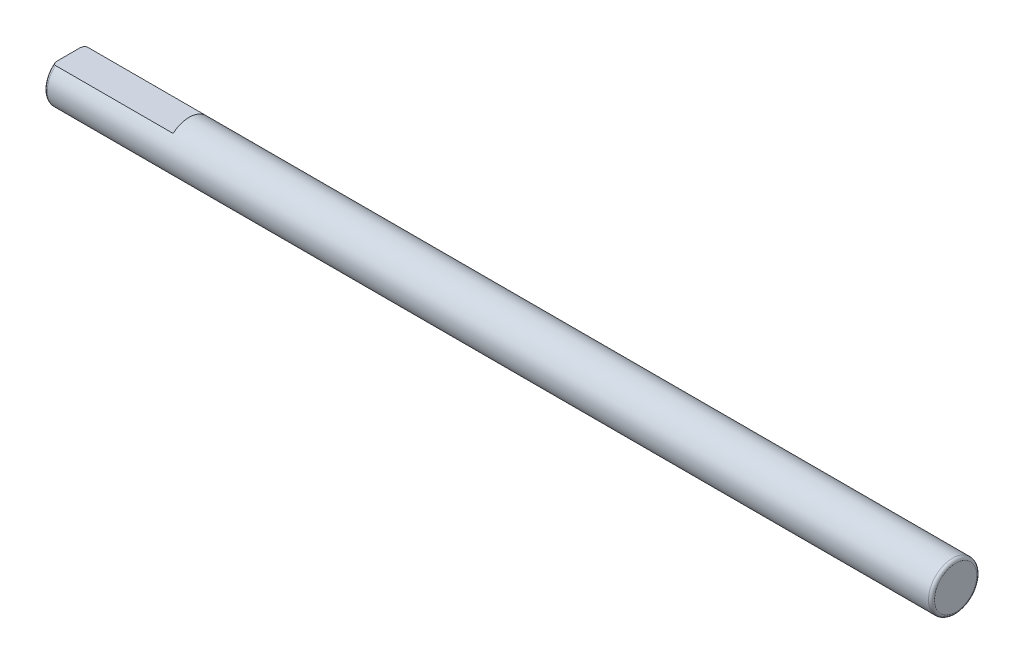
ISO-10303-21;
HEADER;
FILE_DESCRIPTION(('STEP AP214'),'2;1');
FILE_NAME('part.step','',(''),(''),'','','');
FILE_SCHEMA(('AUTOMOTIVE_DESIGN { 1 0 10303 214 1 1 1 1 }'));
ENDSEC;
DATA;
#1=APPLICATION_CONTEXT('core data for automotive mechanical design processes');
#2=APPLICATION_PROTOCOL_DEFINITION('international standard','automotive_design',2000,#1);
#3=PRODUCT_CONTEXT('',#1,'mechanical');
#4=PRODUCT('Part','Part','',(#3));
#5=PRODUCT_RELATED_PRODUCT_CATEGORY('part','',(#4));
#6=PRODUCT_DEFINITION_FORMATION('','',#4);
#7=PRODUCT_DEFINITION_CONTEXT('part definition',#1,'design');
#8=PRODUCT_DEFINITION('design','',#6,#7);
#9=PRODUCT_DEFINITION_SHAPE('','',#8);
#10=(LENGTH_UNIT() NAMED_UNIT(*) SI_UNIT(.MILLI.,.METRE.));
#11=(NAMED_UNIT(*) PLANE_ANGLE_UNIT() SI_UNIT($,.RADIAN.));
#12=(NAMED_UNIT(*) SI_UNIT($,.STERADIAN.) SOLID_ANGLE_UNIT());
#13=UNCERTAINTY_MEASURE_WITH_UNIT(LENGTH_MEASURE(1.E-05),#10,'distance_accuracy_value','');
#14=(GEOMETRIC_REPRESENTATION_CONTEXT(3) GLOBAL_UNCERTAINTY_ASSIGNED_CONTEXT((#13)) GLOBAL_UNIT_ASSIGNED_CONTEXT((#10,
#11,#12)) REPRESENTATION_CONTEXT('',''));
#15=CARTESIAN_POINT('',(0.,0.,0.));
#16=DIRECTION('',(0.,0.,1.));
#17=DIRECTION('',(1.,0.,0.));
#18=AXIS2_PLACEMENT_3D('',#15,#16,#17);
#19=CARTESIAN_POINT('',(147.,0.,0.));
#20=DIRECTION('',(-1.,0.,0.));
#21=DIRECTION('',(0.,0.,1.));
#22=AXIS2_PLACEMENT_3D('',#19,#20,#21);
#23=CYLINDRICAL_SURFACE('',#22,4.);
#24=CARTESIAN_POINT('',(146.5,0.,0.));
#25=DIRECTION('',(1.,0.,0.));
#26=DIRECTION('',(0.,0.,-1.));
#27=AXIS2_PLACEMENT_3D('',#24,#25,#26);
#28=CIRCLE('',#27,4.);
#29=CARTESIAN_POINT('',(146.5,0.,-4.));
#30=VERTEX_POINT('',#29);
#31=EDGE_CURVE('E76',#30,#30,#28,.F.);
#32=ORIENTED_EDGE('',*,*,#31,.T.);
#33=EDGE_LOOP('',(#32));
#34=FACE_BOUND('',#33,.T.);
#35=CARTESIAN_POINT('',(20.,0.,0.));
#36=DIRECTION('',(-1.,0.,0.));
#37=DIRECTION('',(0.,0.,1.));
#38=AXIS2_PLACEMENT_3D('',#35,#36,#37);
#39=CIRCLE('',#38,4.);
#40=CARTESIAN_POINT('',(20.,3.,2.64575131106459));
#41=VERTEX_POINT('',#40);
#42=CARTESIAN_POINT('',(20.,3.,-2.64575131106459));
#43=VERTEX_POINT('',#42);
#44=EDGE_CURVE('E11',#41,#43,#39,.T.);
#45=ORIENTED_EDGE('',*,*,#44,.F.);
#46=DIRECTION('',(-1.,0.,0.));
#47=VECTOR('',#46,1.);
#48=CARTESIAN_POINT('',(147.,3.,2.64575131106459));
#49=LINE('',#48,#47);
#50=CARTESIAN_POINT('',(0.499999999999951,3.,2.64575131106459));
#51=VERTEX_POINT('',#50);
#52=EDGE_CURVE('E118',#41,#51,#49,.T.);
#53=ORIENTED_EDGE('',*,*,#52,.T.);
#54=CARTESIAN_POINT('',(0.5,0.,0.));
#55=DIRECTION('',(1.,0.,0.));
#56=DIRECTION('',(0.,0.,-1.));
#57=AXIS2_PLACEMENT_3D('',#54,#55,#56);
#58=CIRCLE('',#57,4.);
#59=CARTESIAN_POINT('',(0.50000000000005,3.,-2.64575131106459));
#60=VERTEX_POINT('',#59);
#61=EDGE_CURVE('E80',#51,#60,#58,.T.);
#62=ORIENTED_EDGE('',*,*,#61,.T.);
#63=DIRECTION('',(-1.,0.,0.));
#64=VECTOR('',#63,1.);
#65=CARTESIAN_POINT('',(147.,3.,-2.64575131106459));
#66=LINE('',#65,#64);
#67=EDGE_CURVE('E54',#60,#43,#66,.F.);
#68=ORIENTED_EDGE('',*,*,#67,.T.);
#69=EDGE_LOOP('',(#45,#53,#62,#68));
#70=FACE_BOUND('',#69,.T.);
#71=ADVANCED_FACE('F32',(#34,#70),#23,.T.);
#72=CARTESIAN_POINT('',(147.,0.,0.));
#73=DIRECTION('',(1.,0.,0.));
#74=DIRECTION('',(0.,0.,-1.));
#75=AXIS2_PLACEMENT_3D('',#72,#73,#74);
#76=PLANE('',#75);
#77=CARTESIAN_POINT('',(147.,0.,0.));
#78=DIRECTION('',(1.,0.,0.));
#79=DIRECTION('',(0.,0.,-1.));
#80=AXIS2_PLACEMENT_3D('',#77,#78,#79);
#81=CIRCLE('',#80,3.5);
#82=CARTESIAN_POINT('',(147.,0.,-3.5));
#83=VERTEX_POINT('',#82);
#84=EDGE_CURVE('E116',#83,#83,#81,.T.);
#85=ORIENTED_EDGE('',*,*,#84,.T.);
#86=EDGE_LOOP('',(#85));
#87=FACE_BOUND('',#86,.T.);
#88=ADVANCED_FACE('F97',(#87),#76,.T.);
#89=CARTESIAN_POINT('',(0.,0.,0.));
#90=DIRECTION('',(1.,0.,0.));
#91=DIRECTION('',(0.,0.,-1.));
#92=AXIS2_PLACEMENT_3D('',#89,#90,#91);
#93=PLANE('',#92);
#94=CARTESIAN_POINT('',(0.,0.,0.));
#95=DIRECTION('',(1.,0.,0.));
#96=DIRECTION('',(0.,0.,-1.));
#97=AXIS2_PLACEMENT_3D('',#94,#95,#96);
#98=CIRCLE('',#97,3.5);
#99=CARTESIAN_POINT('',(0.,3.,-1.802775637732));
#100=VERTEX_POINT('',#99);
#101=CARTESIAN_POINT('',(0.,3.,1.802775637732));
#102=VERTEX_POINT('',#101);
#103=EDGE_CURVE('E73',#100,#102,#98,.F.);
#104=ORIENTED_EDGE('',*,*,#103,.T.);
#105=DIRECTION('',(0.,0.,1.));
#106=VECTOR('',#105,1.);
#107=CARTESIAN_POINT('',(0.,3.,-3.0891487911814));
#108=LINE('',#107,#106);
#109=EDGE_CURVE('E48',#100,#102,#108,.T.);
#110=ORIENTED_EDGE('',*,*,#109,.F.);
#111=EDGE_LOOP('',(#104,#110));
#112=FACE_BOUND('',#111,.T.);
#113=ADVANCED_FACE('F72',(#112),#93,.F.);
#114=CARTESIAN_POINT('',(146.5,0.,0.));
#115=DIRECTION('',(1.,0.,0.));
#116=DIRECTION('',(0.,0.,-1.));
#117=AXIS2_PLACEMENT_3D('',#114,#115,#116);
#118=TOROIDAL_SURFACE('',#117,3.5,0.5);
#119=ORIENTED_EDGE('',*,*,#31,.F.);
#120=EDGE_LOOP('',(#119));
#121=FACE_BOUND('',#120,.T.);
#122=ORIENTED_EDGE('',*,*,#84,.F.);
#123=EDGE_LOOP('',(#122));
#124=FACE_BOUND('',#123,.T.);
#125=ADVANCED_FACE('F104',(#121,#124),#118,.T.);
#126=CARTESIAN_POINT('',(0.5,0.,0.));
#127=DIRECTION('',(1.,0.,0.));
#128=DIRECTION('',(0.,0.,-1.));
#129=AXIS2_PLACEMENT_3D('',#126,#127,#128);
#130=TOROIDAL_SURFACE('',#129,3.5,0.5);
#131=CARTESIAN_POINT('',(0.5,3.,0.));
#132=CARTESIAN_POINT('',(0.500000809088146,3.,-3.2934607506314E-10));
#133=CARTESIAN_POINT('',(0.500001618108411,3.,-1.67667279640265E-07));
#134=CARTESIAN_POINT('',(0.500003176606055,3.,-6.9945231536977E-07));
#135=CARTESIAN_POINT('',(0.500003923981369,3.,-1.06892420157277E-06));
#136=CARTESIAN_POINT('',(0.500005413740321,3.,-1.9570834816732E-06));
#137=CARTESIAN_POINT('',(0.500006149872059,3.,-2.48605601121779E-06));
#138=CARTESIAN_POINT('',(0.50000754034948,3.,-3.62802522910673E-06));
#139=CARTESIAN_POINT('',(0.500008195307211,3.,-4.24030942558303E-06));
#140=CARTESIAN_POINT('',(0.500010385105272,3.,-6.43180846500297E-06));
#141=CARTESIAN_POINT('',(0.500011811987412,3.,-8.12039536722845E-06));
#142=CARTESIAN_POINT('',(0.500014359628101,3.,-1.16140419291981E-05));
#143=CARTESIAN_POINT('',(0.500015489395678,3.,-1.34129078724813E-05));
#144=CARTESIAN_POINT('',(0.50001971989055,3.,-2.04163342887109E-05));
#145=CARTESIAN_POINT('',(0.500022598011228,3.,-2.57614968734041E-05));
#146=CARTESIAN_POINT('',(0.500027318652184,3.,-3.63150304880423E-05));
#147=CARTESIAN_POINT('',(0.50002923041933,3.,-4.14934293805156E-05));
#148=CARTESIAN_POINT('',(0.500037327276918,3.,-6.35047206306328E-05));
#149=CARTESIAN_POINT('',(0.500043450710295,3.,-8.03491167271492E-05));
#150=CARTESIAN_POINT('',(0.500053306845904,3.,-0.000111903145406854));
#151=CARTESIAN_POINT('',(0.500057262814986,3.,-0.000126540106854419));
#152=CARTESIAN_POINT('',(0.500088519055675,3.,-0.000232715488464067));
#153=CARTESIAN_POINT('',(0.500128266452262,3.,-0.000320029134275242));
#154=CARTESIAN_POINT('',(0.500276959950626,3.,-0.000659124701096024));
#155=CARTESIAN_POINT('',(0.500376660339702,3.,-0.000913839636284209));
#156=CARTESIAN_POINT('',(0.500769024539738,3.,-0.00190151482622701));
#157=CARTESIAN_POINT('',(0.50107137796929,3.,-0.00263146538292722));
#158=CARTESIAN_POINT('',(0.502303116986653,3.,-0.00561938141922183));
#159=CARTESIAN_POINT('',(0.503221567826035,3.,-0.00788067423083214));
#160=CARTESIAN_POINT('',(0.521363727066382,3.,-0.0525294961269583));
#161=CARTESIAN_POINT('',(0.538706292206086,3.,-0.0948814603897114));
#162=CARTESIAN_POINT('',(0.572537841038551,3.,-0.178106178364997));
#163=CARTESIAN_POINT('',(0.589034737743194,3.,-0.218975962780763));
#164=CARTESIAN_POINT('',(0.623682560408479,3.,-0.305580211857914));
#165=CARTESIAN_POINT('',(0.641802551140837,3.,-0.35132729187215));
#166=CARTESIAN_POINT('',(0.677703045345115,3.,-0.443490069714424));
#167=CARTESIAN_POINT('',(0.695478237205682,3.,-0.489907841384319));
#168=CARTESIAN_POINT('',(0.725749928723063,3.,-0.570834253560249));
#169=CARTESIAN_POINT('',(0.738410736434121,3.,-0.605281249358845));
#170=CARTESIAN_POINT('',(0.763222224720536,3.,-0.674264199384321));
#171=CARTESIAN_POINT('',(0.775374066081844,3.,-0.708799736354263));
#172=CARTESIAN_POINT('',(0.810446908527797,3.,-0.811138279206476));
#173=CARTESIAN_POINT('',(0.832571047185817,3.,-0.879218053507057));
#174=CARTESIAN_POINT('',(0.876921950991112,3.,-1.02618826213861));
#175=CARTESIAN_POINT('',(0.898699659227395,3.,-1.10521659285786));
#176=CARTESIAN_POINT('',(0.937294199860766,3.,-1.26517799044851));
#177=CARTESIAN_POINT('',(0.954069937301385,3.,-1.346121239105));
#178=CARTESIAN_POINT('',(0.981496647216805,3.,-1.51404150066003));
#179=CARTESIAN_POINT('',(0.991723486153632,3.,-1.60109082141265));
#180=CARTESIAN_POINT('',(1.0016304665507,3.,-1.77557216985603));
#181=CARTESIAN_POINT('',(1.00135814278864,3.,-1.86300068112729));
#182=CARTESIAN_POINT('',(0.988651759554046,3.,-2.01061403624832));
#183=CARTESIAN_POINT('',(0.979893031996419,3.,-2.07109870196367));
#184=CARTESIAN_POINT('',(0.953502893424042,3.,-2.18949411855467));
#185=CARTESIAN_POINT('',(0.935986358665715,3.,-2.24742789116418));
#186=CARTESIAN_POINT('',(0.900039704312819,3.,-2.33381307952221));
#187=CARTESIAN_POINT('',(0.885506746912705,3.,-2.36388244266121));
#188=CARTESIAN_POINT('',(0.85245040783283,3.,-2.42185524072283));
#189=CARTESIAN_POINT('',(0.833922633916885,3.,-2.44975624526212));
#190=CARTESIAN_POINT('',(0.7965825454489,3.,-2.49689419782548));
#191=CARTESIAN_POINT('',(0.778559028637205,3.,-2.51675087661283));
#192=CARTESIAN_POINT('',(0.739572103071065,3.,-2.55333362983963));
#193=CARTESIAN_POINT('',(0.718614464165329,3.,-2.57006570152396));
#194=CARTESIAN_POINT('',(0.67891078425283,3.,-2.59602672464035));
#195=CARTESIAN_POINT('',(0.660717264579315,3.,-2.60609681859337));
#196=CARTESIAN_POINT('',(0.622912563737041,3.,-2.623112296613));
#197=CARTESIAN_POINT('',(0.603302253722279,3.,-2.63005958216399));
#198=CARTESIAN_POINT('',(0.56301476320006,3.,-2.64036273771542));
#199=CARTESIAN_POINT('',(0.542331701205913,3.,-2.64369598136285));
#200=CARTESIAN_POINT('',(0.500707916843597,3.,-2.64640559948722));
#201=CARTESIAN_POINT('',(0.479767281713323,3.,-2.64578327874975));
#202=CARTESIAN_POINT('',(0.440427583184487,3.,-2.64089905702711));
#203=CARTESIAN_POINT('',(0.421981538311264,3.,-2.63700214813721));
#204=CARTESIAN_POINT('',(0.385956215176315,3.,-2.62631149761408));
#205=CARTESIAN_POINT('',(0.36837708063967,3.,-2.61951727742486));
#206=CARTESIAN_POINT('',(0.333556054029368,3.,-2.60301019185976));
#207=CARTESIAN_POINT('',(0.316376843936938,3.,-2.5931663991519));
#208=CARTESIAN_POINT('',(0.283553635483454,3.,-2.57120495735787));
#209=CARTESIAN_POINT('',(0.267910319926095,3.,-2.55908630385892));
#210=CARTESIAN_POINT('',(0.229405446050632,3.,-2.52528761959886));
#211=CARTESIAN_POINT('',(0.207773904467145,3.,-2.50220323171021));
#212=CARTESIAN_POINT('',(0.168418923512549,3.,-2.45289119290977));
#213=CARTESIAN_POINT('',(0.150708217228096,3.,-2.42665371575611));
#214=CARTESIAN_POINT('',(0.110266308186318,3.,-2.35741023828566));
#215=CARTESIAN_POINT('',(0.0899740483454385,3.,-2.31298826255613));
#216=CARTESIAN_POINT('',(0.0564099001066308,3.,-2.22176394892125));
#217=CARTESIAN_POINT('',(0.043130411782171,3.,-2.17496424838651));
#218=CARTESIAN_POINT('',(0.0237633730551337,3.,-2.08697565597443));
#219=CARTESIAN_POINT('',(0.0169163061931374,3.,-2.04594747659781));
#220=CARTESIAN_POINT('',(0.00675967641004121,3.,-1.9634385868835));
#221=CARTESIAN_POINT('',(0.00345312236565857,3.,-1.9219575218554));
#222=CARTESIAN_POINT('',(-0.00201025293698873,3.,-1.79591946738754));
#223=CARTESIAN_POINT('',(0.000554770585140939,3.,-1.71115993553401));
#224=CARTESIAN_POINT('',(0.0174300288954169,3.,-1.51140251574389));
#225=CARTESIAN_POINT('',(0.0357272025744261,3.,-1.39679487716935));
#226=CARTESIAN_POINT('',(0.0838375443384744,3.,-1.16962376031828));
#227=CARTESIAN_POINT('',(0.113705882630573,3.,-1.05707282200538));
#228=CARTESIAN_POINT('',(0.178080307857804,3.,-0.844082202523085));
#229=CARTESIAN_POINT('',(0.21195188804201,3.,-0.74344452314468));
#230=CARTESIAN_POINT('',(0.283327157203447,3.,-0.544693937069991));
#231=CARTESIAN_POINT('',(0.320788645994851,3.,-0.446565585026118));
#232=CARTESIAN_POINT('',(0.368707849371471,3.,-0.324872681130772));
#233=CARTESIAN_POINT('',(0.3782096425379,3.,-0.300922641925631));
#234=CARTESIAN_POINT('',(0.39756530065873,3.,-0.252430502986033));
#235=CARTESIAN_POINT('',(0.407421839456958,3.,-0.227889458246371));
#236=CARTESIAN_POINT('',(0.43092611634603,3.,-0.169596396492738));
#237=CARTESIAN_POINT('',(0.444603443763393,3.,-0.135856755555247));
#238=CARTESIAN_POINT('',(0.470842624326647,3.,-0.0714698247451515));
#239=CARTESIAN_POINT('',(0.483393596859186,3.,-0.0408185928270958));
#240=CARTESIAN_POINT('',(0.496776257167533,3.,-0.00788623845360394));
#241=CARTESIAN_POINT('',(0.497692413042641,3.,-0.00563047352138915));
#242=CARTESIAN_POINT('',(0.49892354895344,3.,-0.0026439047168306));
#243=CARTESIAN_POINT('',(0.499227629346511,3.,-0.00190978863955239));
#244=CARTESIAN_POINT('',(0.499622097652642,3.,-0.000916812623804387));
#245=CARTESIAN_POINT('',(0.49972223716506,3.,-0.000660978772585737));
#246=CARTESIAN_POINT('',(0.499871515509436,3.,-0.000320570794487707));
#247=CARTESIAN_POINT('',(0.499911357741668,3.,-0.000233049169458826));
#248=CARTESIAN_POINT('',(0.499942667595315,3.,-0.000126636222343927));
#249=CARTESIAN_POINT('',(0.49994662572238,3.,-0.00011198349258714));
#250=CARTESIAN_POINT('',(0.499956493457853,3.,-8.03948799674941E-05));
#251=CARTESIAN_POINT('',(0.499962627668005,3.,-6.35320960836763E-05));
#252=CARTESIAN_POINT('',(0.499970738141426,3.,-4.15001682322679E-05));
#253=CARTESIAN_POINT('',(0.499972652283502,3.,-3.63192959757123E-05));
#254=CARTESIAN_POINT('',(0.499977379167323,3.,-2.57611213342259E-05));
#255=CARTESIAN_POINT('',(0.499980261301865,3.,-2.04138799617288E-05));
#256=CARTESIAN_POINT('',(0.499984497373793,3.,-1.34085100346821E-05));
#257=CARTESIAN_POINT('',(0.499985628444553,3.,-1.16094520804406E-05));
#258=CARTESIAN_POINT('',(0.499988178909839,3.,-8.11568090045751E-06));
#259=CARTESIAN_POINT('',(0.499989607322178,3.,-6.42717404158496E-06));
#260=CARTESIAN_POINT('',(0.499991799264343,3.,-4.23609541338912E-06));
#261=CARTESIAN_POINT('',(0.499992454809909,3.,-3.62399400351353E-06));
#262=CARTESIAN_POINT('',(0.499993846467545,3.,-2.48249549911878E-06));
#263=CARTESIAN_POINT('',(0.499994583191879,3.,-1.95381202778724E-06));
#264=CARTESIAN_POINT('',(0.499996074032542,3.,-1.06635169280823E-06));
#265=CARTESIAN_POINT('',(0.499996821897943,3.,-6.97275834581454E-07));
#266=CARTESIAN_POINT('',(0.499998381265326,3.,-1.66450950331506E-07));
#267=CARTESIAN_POINT('',(0.499999190666624,3.,3.29445898566957E-10));
#268=CARTESIAN_POINT('',(0.5,3.,0.));
#269=B_SPLINE_CURVE_WITH_KNOTS('',3,(#131,#132,#133,#134,#135,#136,#137,#138,#139,#140,#141,
#142,#143,#144,#145,#146,#147,#148,#149,#150,#151,#152,#153,#154,#155,#156,#157,#158,#159,#160,
#161,#162,#163,#164,#165,#166,#167,#168,#169,#170,#171,#172,#173,#174,#175,#176,#177,#178,#179,
#180,#181,#182,#183,#184,#185,#186,#187,#188,#189,#190,#191,#192,#193,#194,#195,#196,#197,#198,
#199,#200,#201,#202,#203,#204,#205,#206,#207,#208,#209,#210,#211,#212,#213,#214,#215,#216,#217,
#218,#219,#220,#221,#222,#223,#224,#225,#226,#227,#228,#229,#230,#231,#232,#233,#234,#235,#236,
#237,#238,#239,#240,#241,#242,#243,#244,#245,#246,#247,#248,#249,#250,#251,#252,#253,#254,#255,
#256,#257,#258,#259,#260,#261,#262,#263,#264,#265,#266,#267,#268),.UNSPECIFIED.,.T.,.F.,(4,2,2,
2,2,2,2,2,2,2,2,2,2,2,2,2,2,2,2,2,2,2,2,2,2,2,2,2,2,2,2,2,2,2,2,2,2,2,2,2,2,2,2,2,2,2,2,2,2,2,2,
2,2,2,2,2,2,2,2,2,2,2,2,2,2,2,2,2,4),(0.,2.42577140557126E-06,4.91478110570216E-06,
7.62327817523988E-06,1.03099186208152E-05,1.69098728522729E-05,2.32774624627675E-05,
4.14315821071887E-05,5.79742803822167E-05,0.000111731604111281,0.000157176209987339,
0.000443854285448882,0.00126537151567835,0.00363449825944129,0.0109577843232788,
0.14823796152855,0.280462080852896,0.428073969058702,0.577183919440007,0.687280760477523,
0.797111062900995,1.01181718035164,1.25761408968685,1.50537803059263,1.76789367938719,
2.02922093329222,2.21210120104423,2.39264319721214,2.4926047048953,2.59267668424855,
2.67285452731945,2.75287686200225,2.81501496252162,2.87711517560124,2.93960197229294,
3.00206815811057,3.05837386128685,3.11468886821825,3.17386957128519,3.23307646596263,
3.32744250264447,3.42211064246199,3.56780261152902,3.71333636463611,3.83794603621182,
3.96266152248216,4.21629845213776,4.56358436079346,4.9125468888076,5.23097433673934,
5.5460342126434,5.62333278485183,5.70267125442574,5.81189399554254,5.9112473332884,
5.91855267841801,5.92093532155446,5.92176045135823,5.92204781085149,5.92209330261594,
5.92214712248503,5.92216367456895,5.92218183971372,5.92218820986477,5.92219481255307,
5.922197500105,5.92220020952932,5.92220269932133,5.92220512582798),.UNSPECIFIED.);
#270=EDGE_CURVE('E41',#60,#100,#269,.T.);
#271=ORIENTED_EDGE('',*,*,#270,.F.);
#272=ORIENTED_EDGE('',*,*,#61,.F.);
#273=CARTESIAN_POINT('',(0.5,3.,0.));
#274=CARTESIAN_POINT('',(0.499999190911855,3.,3.29346080531089E-10));
#275=CARTESIAN_POINT('',(0.49999838189159,3.,1.67667279645256E-07));
#276=CARTESIAN_POINT('',(0.499996823393946,3.,6.99452315387634E-07));
#277=CARTESIAN_POINT('',(0.499996076018632,3.,1.06892420161261E-06));
#278=CARTESIAN_POINT('',(0.49999458625968,3.,1.95708348167848E-06));
#279=CARTESIAN_POINT('',(0.499993850127941,3.,2.48605601116866E-06));
#280=CARTESIAN_POINT('',(0.49999245965052,3.,3.62802522906312E-06));
#281=CARTESIAN_POINT('',(0.499991804692789,3.,4.24030942558021E-06));
#282=CARTESIAN_POINT('',(0.499989614894729,3.,6.43180846513845E-06));
#283=CARTESIAN_POINT('',(0.499988188012589,3.,8.12039536717703E-06));
#284=CARTESIAN_POINT('',(0.499985640371899,3.,1.16140419290538E-05));
#285=CARTESIAN_POINT('',(0.499984510604323,3.,1.34129078724051E-05));
#286=CARTESIAN_POINT('',(0.499980280109451,3.,2.04163342888789E-05));
#287=CARTESIAN_POINT('',(0.499977401988773,3.,2.57614968734216E-05));
#288=CARTESIAN_POINT('',(0.499972681347817,3.,3.63150304879688E-05));
#289=CARTESIAN_POINT('',(0.499970769580671,3.,4.14934293804847E-05));
#290=CARTESIAN_POINT('',(0.499962672723083,3.,6.35047206307141E-05));
#291=CARTESIAN_POINT('',(0.499956549289706,3.,8.03491167271915E-05));
#292=CARTESIAN_POINT('',(0.499946693154097,3.,0.000111903145406862));
#293=CARTESIAN_POINT('',(0.499942737185014,3.,0.000126540106854423));
#294=CARTESIAN_POINT('',(0.499911480944326,3.,0.000232715488464098));
#295=CARTESIAN_POINT('',(0.499871733547738,3.,0.000320029134275249));
#296=CARTESIAN_POINT('',(0.499723040049375,3.,0.000659124701095968));
#297=CARTESIAN_POINT('',(0.499623339660299,3.,0.00091383963628417));
#298=CARTESIAN_POINT('',(0.499230975460263,3.,0.00190151482622701));
#299=CARTESIAN_POINT('',(0.498928622030711,3.,0.00263146538292719));
#300=CARTESIAN_POINT('',(0.497696883013348,3.,0.00561938141922179));
#301=CARTESIAN_POINT('',(0.496778432173966,3.,0.00788067423083212));
#302=CARTESIAN_POINT('',(0.478636272933618,3.,0.0525294961269583));
#303=CARTESIAN_POINT('',(0.461293707793911,3.,0.0948814603897104));
#304=CARTESIAN_POINT('',(0.427462158961447,3.,0.178106178364996));
#305=CARTESIAN_POINT('',(0.410965262256806,3.,0.218975962780763));
#306=CARTESIAN_POINT('',(0.376317439591523,3.,0.305580211857916));
#307=CARTESIAN_POINT('',(0.358197448859163,3.,0.351327291872151));
#308=CARTESIAN_POINT('',(0.322296954654884,3.,0.443490069714426));
#309=CARTESIAN_POINT('',(0.304521762794318,3.,0.489907841384323));
#310=CARTESIAN_POINT('',(0.274250071276937,3.,0.570834253560253));
#311=CARTESIAN_POINT('',(0.261589263565879,3.,0.605281249358848));
#312=CARTESIAN_POINT('',(0.236777775279463,3.,0.674264199384323));
#313=CARTESIAN_POINT('',(0.224625933918156,3.,0.708799736354265));
#314=CARTESIAN_POINT('',(0.189553091472204,3.,0.811138279206477));
#315=CARTESIAN_POINT('',(0.167428952814184,3.,0.879218053507057));
#316=CARTESIAN_POINT('',(0.123078049008889,3.,1.02618826213861));
#317=CARTESIAN_POINT('',(0.101300340772606,3.,1.10521659285786));
#318=CARTESIAN_POINT('',(0.0627058001392351,3.,1.26517799044851));
#319=CARTESIAN_POINT('',(0.0459300626986163,3.,1.346121239105));
#320=CARTESIAN_POINT('',(0.0185033527831959,3.,1.51404150066003));
#321=CARTESIAN_POINT('',(0.00827651384636933,3.,1.60109082141265));
#322=CARTESIAN_POINT('',(-0.00163046655070144,3.,1.77557216985603));
#323=CARTESIAN_POINT('',(-0.0013581427886383,3.,1.86300068112729));
#324=CARTESIAN_POINT('',(0.0113482404459548,3.,2.01061403624832));
#325=CARTESIAN_POINT('',(0.020106968003582,3.,2.07109870196367));
#326=CARTESIAN_POINT('',(0.0464971065759595,3.,2.18949411855468));
#327=CARTESIAN_POINT('',(0.0640136413342866,3.,2.24742789116418));
#328=CARTESIAN_POINT('',(0.0999602956871824,3.,2.33381307952221));
#329=CARTESIAN_POINT('',(0.114493253087296,3.,2.36388244266121));
#330=CARTESIAN_POINT('',(0.147549592167171,3.,2.42185524072283));
#331=CARTESIAN_POINT('',(0.166077366083116,3.,2.44975624526212));
#332=CARTESIAN_POINT('',(0.203417454551101,3.,2.49689419782548));
#333=CARTESIAN_POINT('',(0.221440971362795,3.,2.51675087661283));
#334=CARTESIAN_POINT('',(0.260427896928936,3.,2.55333362983963));
#335=CARTESIAN_POINT('',(0.281385535834672,3.,2.57006570152396));
#336=CARTESIAN_POINT('',(0.321089215747171,3.,2.59602672464035));
#337=CARTESIAN_POINT('',(0.339282735420686,3.,2.60609681859337));
#338=CARTESIAN_POINT('',(0.37708743626296,3.,2.623112296613));
#339=CARTESIAN_POINT('',(0.396697746277722,3.,2.63005958216399));
#340=CARTESIAN_POINT('',(0.43698523679994,3.,2.64036273771542));
#341=CARTESIAN_POINT('',(0.457668298794088,3.,2.64369598136285));
#342=CARTESIAN_POINT('',(0.499292083156404,3.,2.64640559948722));
#343=CARTESIAN_POINT('',(0.520232718286677,3.,2.64578327874975));
#344=CARTESIAN_POINT('',(0.559572416815514,3.,2.64089905702711));
#345=CARTESIAN_POINT('',(0.578018461688736,3.,2.63700214813721));
#346=CARTESIAN_POINT('',(0.614043784823686,3.,2.62631149761408));
#347=CARTESIAN_POINT('',(0.631622919360331,3.,2.61951727742486));
#348=CARTESIAN_POINT('',(0.666443945970632,3.,2.60301019185976));
#349=CARTESIAN_POINT('',(0.683623156063063,3.,2.5931663991519));
#350=CARTESIAN_POINT('',(0.716446364516547,3.,2.57120495735787));
#351=CARTESIAN_POINT('',(0.732089680073906,3.,2.55908630385892));
#352=CARTESIAN_POINT('',(0.770594553949369,3.,2.52528761959886));
#353=CARTESIAN_POINT('',(0.792226095532856,3.,2.50220323171021));
#354=CARTESIAN_POINT('',(0.831581076487452,3.,2.45289119290977));
#355=CARTESIAN_POINT('',(0.849291782771905,3.,2.42665371575611));
#356=CARTESIAN_POINT('',(0.889733691813683,3.,2.35741023828566));
#357=CARTESIAN_POINT('',(0.910025951654562,3.,2.31298826255613));
#358=CARTESIAN_POINT('',(0.94359009989337,3.,2.22176394892125));
#359=CARTESIAN_POINT('',(0.95686958821783,3.,2.17496424838651));
#360=CARTESIAN_POINT('',(0.976236626944867,3.,2.08697565597443));
#361=CARTESIAN_POINT('',(0.983083693806863,3.,2.04594747659781));
#362=CARTESIAN_POINT('',(0.993240323589959,3.,1.9634385868835));
#363=CARTESIAN_POINT('',(0.996546877634342,3.,1.9219575218554));
#364=CARTESIAN_POINT('',(1.00201025293699,3.,1.79591946738754));
#365=CARTESIAN_POINT('',(0.99944522941486,3.,1.71115993553401));
#366=CARTESIAN_POINT('',(0.982569971104584,3.,1.5114025157439));
#367=CARTESIAN_POINT('',(0.964272797425575,3.,1.39679487716935));
#368=CARTESIAN_POINT('',(0.916162455661528,3.,1.16962376031828));
#369=CARTESIAN_POINT('',(0.88629411736943,3.,1.05707282200538));
#370=CARTESIAN_POINT('',(0.821919692142198,3.,0.844082202523089));
#371=CARTESIAN_POINT('',(0.788048111957992,3.,0.743444523144685));
#372=CARTESIAN_POINT('',(0.716672842796557,3.,0.544693937069997));
#373=CARTESIAN_POINT('',(0.679211354005154,3.,0.446565585026125));
#374=CARTESIAN_POINT('',(0.631292150628532,3.,0.32487268113078));
#375=CARTESIAN_POINT('',(0.621790357462102,3.,0.300922641925638));
#376=CARTESIAN_POINT('',(0.602434699341271,3.,0.252430502986038));
#377=CARTESIAN_POINT('',(0.592578160543043,3.,0.227889458246376));
#378=CARTESIAN_POINT('',(0.569073883653971,3.,0.169596396492741));
#379=CARTESIAN_POINT('',(0.555396556236608,3.,0.135856755555249));
#380=CARTESIAN_POINT('',(0.529157375673355,3.,0.0714698247451526));
#381=CARTESIAN_POINT('',(0.516606403140817,3.,0.0408185928270963));
#382=CARTESIAN_POINT('',(0.503223742832466,3.,0.00788623845360452));
#383=CARTESIAN_POINT('',(0.502307586957358,3.,0.00563047352138977));
#384=CARTESIAN_POINT('',(0.501076451046561,3.,0.00264390471683072));
#385=CARTESIAN_POINT('',(0.500772370653491,3.,0.00190978863955234));
#386=CARTESIAN_POINT('',(0.500377902347358,3.,0.000916812623804518));
#387=CARTESIAN_POINT('',(0.50027776283494,3.,0.000660978772585944));
#388=CARTESIAN_POINT('',(0.500128484490565,3.,0.000320570794487669));
#389=CARTESIAN_POINT('',(0.500088642258334,3.,0.00023304916945869));
#390=CARTESIAN_POINT('',(0.500057332404686,3.,0.000126636222343655));
#391=CARTESIAN_POINT('',(0.500053374277621,3.,0.000111983492586593));
#392=CARTESIAN_POINT('',(0.500043506542147,3.,8.03948799666229E-05));
#393=CARTESIAN_POINT('',(0.500037372331995,3.,6.35320960827373E-05));
#394=CARTESIAN_POINT('',(0.500029261858575,3.,4.15001682315285E-05));
#395=CARTESIAN_POINT('',(0.500027347716499,3.,3.63192959751632E-05));
#396=CARTESIAN_POINT('',(0.500022620832677,3.,2.57611213340422E-05));
#397=CARTESIAN_POINT('',(0.500019738698135,3.,2.04138799617154E-05));
#398=CARTESIAN_POINT('',(0.500015502626208,3.,1.34085100348346E-05));
#399=CARTESIAN_POINT('',(0.500014371555448,3.,1.16094520805854E-05));
#400=CARTESIAN_POINT('',(0.500011821090162,3.,8.11568090056396E-06));
#401=CARTESIAN_POINT('',(0.500010392677823,3.,6.42717404166035E-06));
#402=CARTESIAN_POINT('',(0.500008200735658,3.,4.23609541366498E-06));
#403=CARTESIAN_POINT('',(0.500007545190092,3.,3.62399400398315E-06));
#404=CARTESIAN_POINT('',(0.500006153532457,3.,2.48249549970985E-06));
#405=CARTESIAN_POINT('',(0.500005416808123,3.,1.95381202833283E-06));
#406=CARTESIAN_POINT('',(0.500003925967459,3.,1.06635169308962E-06));
#407=CARTESIAN_POINT('',(0.500003178102058,3.,6.97275834686607E-07));
#408=CARTESIAN_POINT('',(0.500001618734675,3.,1.66450950329229E-07));
#409=CARTESIAN_POINT('',(0.500000809333377,3.,-3.29445904050994E-10));
#410=CARTESIAN_POINT('',(0.5,3.,0.));
#411=B_SPLINE_CURVE_WITH_KNOTS('',3,(#273,#274,#275,#276,#277,#278,#279,#280,#281,#282,#283,
#284,#285,#286,#287,#288,#289,#290,#291,#292,#293,#294,#295,#296,#297,#298,#299,#300,#301,#302,
#303,#304,#305,#306,#307,#308,#309,#310,#311,#312,#313,#314,#315,#316,#317,#318,#319,#320,#321,
#322,#323,#324,#325,#326,#327,#328,#329,#330,#331,#332,#333,#334,#335,#336,#337,#338,#339,#340,
#341,#342,#343,#344,#345,#346,#347,#348,#349,#350,#351,#352,#353,#354,#355,#356,#357,#358,#359,
#360,#361,#362,#363,#364,#365,#366,#367,#368,#369,#370,#371,#372,#373,#374,#375,#376,#377,#378,
#379,#380,#381,#382,#383,#384,#385,#386,#387,#388,#389,#390,#391,#392,#393,#394,#395,#396,#397,
#398,#399,#400,#401,#402,#403,#404,#405,#406,#407,#408,#409,#410),.UNSPECIFIED.,.T.,.F.,(4,2,2,
2,2,2,2,2,2,2,2,2,2,2,2,2,2,2,2,2,2,2,2,2,2,2,2,2,2,2,2,2,2,2,2,2,2,2,2,2,2,2,2,2,2,2,2,2,2,2,2,
2,2,2,2,2,2,2,2,2,2,2,2,2,2,2,2,2,4),(0.,2.42577140546556E-06,4.91478110559445E-06,
7.623278175403E-06,1.03099186207141E-05,1.69098728524453E-05,2.32774624627459E-05,
4.14315821071879E-05,5.79742803822458E-05,0.000111731604111342,0.000157176209987366,
0.000443854285448902,0.00126537151567835,0.00363449825944123,0.0109577843232789,
0.14823796152855,0.280462080852897,0.428073969058704,0.577183919440011,0.687280760477526,
0.797111062900997,1.01181718035164,1.25761408968685,1.50537803059262,1.76789367938719,
2.02922093329222,2.21210120104423,2.39264319721214,2.4926047048953,2.59267668424855,
2.67285452731945,2.75287686200225,2.81501496252162,2.87711517560124,2.93960197229294,
3.00206815811057,3.05837386128685,3.11468886821825,3.17386957128519,3.23307646596263,
3.32744250264447,3.42211064246199,3.56780261152902,3.71333636463611,3.83794603621182,
3.96266152248216,4.21629845213776,4.56358436079346,4.9125468888076,5.23097433673933,
5.54603421264339,5.62333278485183,5.70267125442574,5.81189399554254,5.9112473332884,
5.91855267841802,5.92093532155446,5.92176045135823,5.92204781085149,5.92209330261594,
5.92214712248503,5.92216367456895,5.92218183971372,5.92218820986477,5.92219481255307,
5.922197500105,5.92220020952932,5.92220269932133,5.92220512582798),.UNSPECIFIED.);
#412=EDGE_CURVE('E69',#102,#51,#411,.T.);
#413=ORIENTED_EDGE('',*,*,#412,.F.);
#414=ORIENTED_EDGE('',*,*,#103,.F.);
#415=EDGE_LOOP('',(#271,#272,#413,#414));
#416=FACE_BOUND('',#415,.T.);
#417=ADVANCED_FACE('F34',(#416),#130,.T.);
#418=CARTESIAN_POINT('',(20.,0.,0.));
#419=DIRECTION('',(-1.,0.,0.));
#420=DIRECTION('',(0.,0.,1.));
#421=AXIS2_PLACEMENT_3D('',#418,#419,#420);
#422=PLANE('',#421);
#423=ORIENTED_EDGE('',*,*,#44,.T.);
#424=DIRECTION('',(0.,0.,1.));
#425=VECTOR('',#424,1.);
#426=CARTESIAN_POINT('',(20.,3.,-3.0891487911814));
#427=LINE('',#426,#425);
#428=EDGE_CURVE('E74',#43,#41,#427,.T.);
#429=ORIENTED_EDGE('',*,*,#428,.T.);
#430=EDGE_LOOP('',(#423,#429));
#431=FACE_BOUND('',#430,.T.);
#432=ADVANCED_FACE('F96',(#431),#422,.T.);
#433=CARTESIAN_POINT('',(20.,3.,-3.0891487911814));
#434=DIRECTION('',(0.,-1.,0.));
#435=DIRECTION('',(0.,0.,-1.));
#436=AXIS2_PLACEMENT_3D('',#433,#434,#435);
#437=PLANE('',#436);
#438=ORIENTED_EDGE('',*,*,#270,.T.);
#439=ORIENTED_EDGE('',*,*,#109,.T.);
#440=ORIENTED_EDGE('',*,*,#412,.T.);
#441=ORIENTED_EDGE('',*,*,#52,.F.);
#442=ORIENTED_EDGE('',*,*,#428,.F.);
#443=ORIENTED_EDGE('',*,*,#67,.F.);
#444=EDGE_LOOP('',(#438,#439,#440,#441,#442,#443));
#445=FACE_BOUND('',#444,.T.);
#446=ADVANCED_FACE('F64',(#445),#437,.F.);
#447=CLOSED_SHELL('',(#71,#88,#113,#125,#417,#432,#446));
#448=MANIFOLD_SOLID_BREP('B2',#447);
#449=ADVANCED_BREP_SHAPE_REPRESENTATION('',(#18,#448),#14);
#450=SHAPE_DEFINITION_REPRESENTATION(#9,#449);
ENDSEC;
END-ISO-10303-21;
